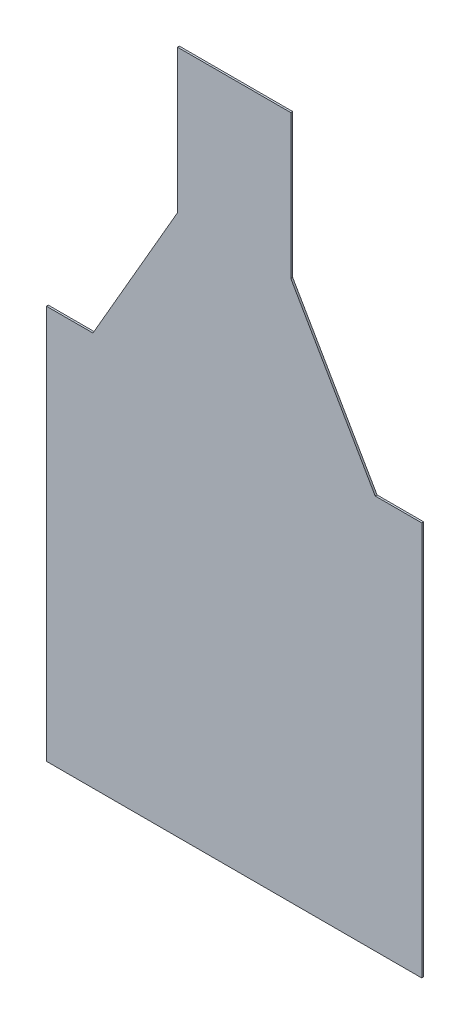
ISO-10303-21;
HEADER;
FILE_DESCRIPTION(('STEP AP214'),'2;1');
FILE_NAME('part.step','',(''),(''),'','','');
FILE_SCHEMA(('AUTOMOTIVE_DESIGN { 1 0 10303 214 1 1 1 1 }'));
ENDSEC;
DATA;
#1=APPLICATION_CONTEXT('core data for automotive mechanical design processes');
#2=APPLICATION_PROTOCOL_DEFINITION('international standard','automotive_design',2000,#1);
#3=PRODUCT_CONTEXT('',#1,'mechanical');
#4=PRODUCT('Part','Part','',(#3));
#5=PRODUCT_RELATED_PRODUCT_CATEGORY('part','',(#4));
#6=PRODUCT_DEFINITION_FORMATION('','',#4);
#7=PRODUCT_DEFINITION_CONTEXT('part definition',#1,'design');
#8=PRODUCT_DEFINITION('design','',#6,#7);
#9=PRODUCT_DEFINITION_SHAPE('','',#8);
#10=(LENGTH_UNIT() NAMED_UNIT(*) SI_UNIT(.MILLI.,.METRE.));
#11=(NAMED_UNIT(*) PLANE_ANGLE_UNIT() SI_UNIT($,.RADIAN.));
#12=(NAMED_UNIT(*) SI_UNIT($,.STERADIAN.) SOLID_ANGLE_UNIT());
#13=UNCERTAINTY_MEASURE_WITH_UNIT(LENGTH_MEASURE(1.E-05),#10,'distance_accuracy_value','');
#14=(GEOMETRIC_REPRESENTATION_CONTEXT(3) GLOBAL_UNCERTAINTY_ASSIGNED_CONTEXT((#13)) GLOBAL_UNIT_ASSIGNED_CONTEXT((#10,
#11,#12)) REPRESENTATION_CONTEXT('',''));
#15=CARTESIAN_POINT('',(0.,0.,0.));
#16=DIRECTION('',(0.,0.,1.));
#17=DIRECTION('',(1.,0.,0.));
#18=AXIS2_PLACEMENT_3D('',#15,#16,#17);
#19=CARTESIAN_POINT('',(-200.,238.575414968693,-2.));
#20=DIRECTION('',(0.,1.,0.));
#21=DIRECTION('',(0.,0.,1.));
#22=AXIS2_PLACEMENT_3D('',#19,#20,#21);
#23=PLANE('',#22);
#24=DIRECTION('',(-1.,0.,0.));
#25=VECTOR('',#24,1.);
#26=CARTESIAN_POINT('',(-200.,238.575414968693,-2.));
#27=LINE('',#26,#25);
#28=CARTESIAN_POINT('',(200.,238.575414968693,-2.));
#29=VERTEX_POINT('',#28);
#30=CARTESIAN_POINT('',(150.373607132281,238.575414968693,-2.));
#31=VERTEX_POINT('',#30);
#32=EDGE_CURVE('E149',#29,#31,#27,.T.);
#33=ORIENTED_EDGE('',*,*,#32,.T.);
#34=DIRECTION('',(0.,0.,1.));
#35=VECTOR('',#34,1.);
#36=CARTESIAN_POINT('',(150.373607132281,238.575414968693,-2.));
#37=LINE('',#36,#35);
#38=CARTESIAN_POINT('',(150.373607132281,238.575414968693,0.));
#39=VERTEX_POINT('',#38);
#40=EDGE_CURVE('E141',#31,#39,#37,.T.);
#41=ORIENTED_EDGE('',*,*,#40,.T.);
#42=DIRECTION('',(-1.,0.,0.));
#43=VECTOR('',#42,1.);
#44=CARTESIAN_POINT('',(-200.,238.575414968693,0.));
#45=LINE('',#44,#43);
#46=CARTESIAN_POINT('',(200.,238.575414968693,0.));
#47=VERTEX_POINT('',#46);
#48=EDGE_CURVE('E175',#47,#39,#45,.T.);
#49=ORIENTED_EDGE('',*,*,#48,.F.);
#50=DIRECTION('',(0.,0.,1.));
#51=VECTOR('',#50,1.);
#52=CARTESIAN_POINT('',(200.,238.575414968693,-2.));
#53=LINE('',#52,#51);
#54=EDGE_CURVE('E85',#29,#47,#53,.T.);
#55=ORIENTED_EDGE('',*,*,#54,.F.);
#56=EDGE_LOOP('',(#33,#41,#49,#55));
#57=FACE_BOUND('',#56,.T.);
#58=ADVANCED_FACE('F35',(#57),#23,.T.);
#59=CARTESIAN_POINT('',(200.,238.575414968693,-2.));
#60=DIRECTION('',(1.,0.,0.));
#61=DIRECTION('',(0.,1.,0.));
#62=AXIS2_PLACEMENT_3D('',#59,#60,#61);
#63=PLANE('',#62);
#64=DIRECTION('',(0.,1.,0.));
#65=VECTOR('',#64,1.);
#66=CARTESIAN_POINT('',(200.,238.575414968693,0.));
#67=LINE('',#66,#65);
#68=CARTESIAN_POINT('',(200.,-181.424585031307,0.));
#69=VERTEX_POINT('',#68);
#70=EDGE_CURVE('E166',#69,#47,#67,.T.);
#71=ORIENTED_EDGE('',*,*,#70,.F.);
#72=DIRECTION('',(0.,0.,1.));
#73=VECTOR('',#72,1.);
#74=CARTESIAN_POINT('',(200.,-181.424585031307,-2.));
#75=LINE('',#74,#73);
#76=CARTESIAN_POINT('',(200.,-181.424585031307,-2.));
#77=VERTEX_POINT('',#76);
#78=EDGE_CURVE('E11',#77,#69,#75,.T.);
#79=ORIENTED_EDGE('',*,*,#78,.F.);
#80=DIRECTION('',(0.,1.,0.));
#81=VECTOR('',#80,1.);
#82=CARTESIAN_POINT('',(200.,238.575414968693,-2.));
#83=LINE('',#82,#81);
#84=EDGE_CURVE('E150',#77,#29,#83,.T.);
#85=ORIENTED_EDGE('',*,*,#84,.T.);
#86=ORIENTED_EDGE('',*,*,#54,.T.);
#87=EDGE_LOOP('',(#71,#79,#85,#86));
#88=FACE_BOUND('',#87,.T.);
#89=ADVANCED_FACE('F37',(#88),#63,.T.);
#90=CARTESIAN_POINT('',(-200.,-181.424585031307,-2.));
#91=DIRECTION('',(0.,-1.,0.));
#92=DIRECTION('',(0.,0.,-1.));
#93=AXIS2_PLACEMENT_3D('',#90,#91,#92);
#94=PLANE('',#93);
#95=DIRECTION('',(1.,0.,0.));
#96=VECTOR('',#95,1.);
#97=CARTESIAN_POINT('',(-200.,-181.424585031307,0.));
#98=LINE('',#97,#96);
#99=CARTESIAN_POINT('',(-200.,-181.424585031307,0.));
#100=VERTEX_POINT('',#99);
#101=EDGE_CURVE('E153',#100,#69,#98,.T.);
#102=ORIENTED_EDGE('',*,*,#101,.F.);
#103=DIRECTION('',(0.,0.,1.));
#104=VECTOR('',#103,1.);
#105=CARTESIAN_POINT('',(-200.,-181.424585031307,-2.));
#106=LINE('',#105,#104);
#107=CARTESIAN_POINT('',(-200.,-181.424585031307,-2.));
#108=VERTEX_POINT('',#107);
#109=EDGE_CURVE('E44',#108,#100,#106,.T.);
#110=ORIENTED_EDGE('',*,*,#109,.F.);
#111=DIRECTION('',(1.,0.,0.));
#112=VECTOR('',#111,1.);
#113=CARTESIAN_POINT('',(-200.,-181.424585031307,-2.));
#114=LINE('',#113,#112);
#115=EDGE_CURVE('E164',#108,#77,#114,.T.);
#116=ORIENTED_EDGE('',*,*,#115,.T.);
#117=ORIENTED_EDGE('',*,*,#78,.T.);
#118=EDGE_LOOP('',(#102,#110,#116,#117));
#119=FACE_BOUND('',#118,.T.);
#120=ADVANCED_FACE('F187',(#119),#94,.T.);
#121=CARTESIAN_POINT('',(-200.,238.575414968693,-2.));
#122=DIRECTION('',(-1.,0.,0.));
#123=DIRECTION('',(0.,-1.,0.));
#124=AXIS2_PLACEMENT_3D('',#121,#122,#123);
#125=PLANE('',#124);
#126=DIRECTION('',(0.,-1.,0.));
#127=VECTOR('',#126,1.);
#128=CARTESIAN_POINT('',(-200.,238.575414968693,0.));
#129=LINE('',#128,#127);
#130=CARTESIAN_POINT('',(-200.,238.575414968693,0.));
#131=VERTEX_POINT('',#130);
#132=EDGE_CURVE('E171',#131,#100,#129,.T.);
#133=ORIENTED_EDGE('',*,*,#132,.F.);
#134=DIRECTION('',(0.,0.,1.));
#135=VECTOR('',#134,1.);
#136=CARTESIAN_POINT('',(-200.,238.575414968693,-2.));
#137=LINE('',#136,#135);
#138=CARTESIAN_POINT('',(-200.,238.575414968693,-2.));
#139=VERTEX_POINT('',#138);
#140=EDGE_CURVE('E179',#139,#131,#137,.T.);
#141=ORIENTED_EDGE('',*,*,#140,.F.);
#142=DIRECTION('',(0.,-1.,0.));
#143=VECTOR('',#142,1.);
#144=CARTESIAN_POINT('',(-200.,238.575414968693,-2.));
#145=LINE('',#144,#143);
#146=EDGE_CURVE('E148',#139,#108,#145,.T.);
#147=ORIENTED_EDGE('',*,*,#146,.T.);
#148=ORIENTED_EDGE('',*,*,#109,.T.);
#149=EDGE_LOOP('',(#133,#141,#147,#148));
#150=FACE_BOUND('',#149,.T.);
#151=ADVANCED_FACE('F188',(#150),#125,.T.);
#152=DIRECTION('',(0.,0.,1.));
#153=VECTOR('',#152,1.);
#154=CARTESIAN_POINT('',(-150.373607132281,238.575414968693,-2.));
#155=LINE('',#154,#153);
#156=CARTESIAN_POINT('',(-150.373607132281,238.575414968693,-2.));
#157=VERTEX_POINT('',#156);
#158=CARTESIAN_POINT('',(-150.373607132281,238.575414968693,0.));
#159=VERTEX_POINT('',#158);
#160=EDGE_CURVE('E124',#157,#159,#155,.T.);
#161=ORIENTED_EDGE('',*,*,#160,.F.);
#162=EDGE_CURVE('E138',#157,#139,#27,.T.);
#163=ORIENTED_EDGE('',*,*,#162,.T.);
#164=ORIENTED_EDGE('',*,*,#140,.T.);
#165=EDGE_CURVE('E140',#159,#131,#45,.T.);
#166=ORIENTED_EDGE('',*,*,#165,.F.);
#167=EDGE_LOOP('',(#161,#163,#164,#166));
#168=FACE_BOUND('',#167,.T.);
#169=ADVANCED_FACE('F136',(#168),#23,.T.);
#170=CARTESIAN_POINT('',(0.,0.,-2.));
#171=DIRECTION('',(0.,0.,1.));
#172=DIRECTION('',(1.,0.,0.));
#173=AXIS2_PLACEMENT_3D('',#170,#171,#172);
#174=PLANE('',#173);
#175=ORIENTED_EDGE('',*,*,#84,.F.);
#176=ORIENTED_EDGE('',*,*,#115,.F.);
#177=ORIENTED_EDGE('',*,*,#146,.F.);
#178=ORIENTED_EDGE('',*,*,#162,.F.);
#179=DIRECTION('',(-0.499999999999998,-0.86602540378444,0.));
#180=VECTOR('',#179,1.);
#181=CARTESIAN_POINT('',(-60.4218344464016,394.376455491523,-2.));
#182=LINE('',#181,#180);
#183=CARTESIAN_POINT('',(-60.4218344464016,394.376455491523,-2.));
#184=VERTEX_POINT('',#183);
#185=EDGE_CURVE('E120',#184,#157,#182,.T.);
#186=ORIENTED_EDGE('',*,*,#185,.F.);
#187=DIRECTION('',(0.,-1.,0.));
#188=VECTOR('',#187,1.);
#189=CARTESIAN_POINT('',(-60.4218344464016,394.376455491523,-2.));
#190=LINE('',#189,#188);
#191=CARTESIAN_POINT('',(-60.4218344464016,547.430628062216,-2.));
#192=VERTEX_POINT('',#191);
#193=EDGE_CURVE('E142',#192,#184,#190,.T.);
#194=ORIENTED_EDGE('',*,*,#193,.F.);
#195=DIRECTION('',(-1.,0.,0.));
#196=VECTOR('',#195,1.);
#197=CARTESIAN_POINT('',(-60.4218344464016,547.430628062216,-2.));
#198=LINE('',#197,#196);
#199=CARTESIAN_POINT('',(60.4218344464016,547.430628062216,-2.));
#200=VERTEX_POINT('',#199);
#201=EDGE_CURVE('E214',#200,#192,#198,.T.);
#202=ORIENTED_EDGE('',*,*,#201,.F.);
#203=DIRECTION('',(0.,1.,0.));
#204=VECTOR('',#203,1.);
#205=CARTESIAN_POINT('',(60.4218344464015,394.376455491523,-2.));
#206=LINE('',#205,#204);
#207=CARTESIAN_POINT('',(60.4218344464015,394.376455491523,-2.));
#208=VERTEX_POINT('',#207);
#209=EDGE_CURVE('E212',#208,#200,#206,.T.);
#210=ORIENTED_EDGE('',*,*,#209,.F.);
#211=DIRECTION('',(-0.499999999999998,0.86602540378444,0.));
#212=VECTOR('',#211,1.);
#213=CARTESIAN_POINT('',(60.4218344464015,394.376455491523,-2.));
#214=LINE('',#213,#212);
#215=EDGE_CURVE('E131',#31,#208,#214,.T.);
#216=ORIENTED_EDGE('',*,*,#215,.F.);
#217=ORIENTED_EDGE('',*,*,#32,.F.);
#218=EDGE_LOOP('',(#175,#176,#177,#178,#186,#194,#202,#210,#216,#217));
#219=FACE_BOUND('',#218,.T.);
#220=ADVANCED_FACE('F145',(#219),#174,.F.);
#221=CARTESIAN_POINT('',(0.,0.,0.));
#222=DIRECTION('',(0.,0.,1.));
#223=DIRECTION('',(1.,0.,0.));
#224=AXIS2_PLACEMENT_3D('',#221,#222,#223);
#225=PLANE('',#224);
#226=ORIENTED_EDGE('',*,*,#70,.T.);
#227=ORIENTED_EDGE('',*,*,#48,.T.);
#228=DIRECTION('',(-0.499999999999998,0.86602540378444,0.));
#229=VECTOR('',#228,1.);
#230=CARTESIAN_POINT('',(60.4218344464015,394.376455491523,0.));
#231=LINE('',#230,#229);
#232=CARTESIAN_POINT('',(60.4218344464015,394.376455491523,0.));
#233=VERTEX_POINT('',#232);
#234=EDGE_CURVE('E52',#39,#233,#231,.T.);
#235=ORIENTED_EDGE('',*,*,#234,.T.);
#236=DIRECTION('',(0.,1.,0.));
#237=VECTOR('',#236,1.);
#238=CARTESIAN_POINT('',(60.4218344464015,394.376455491523,0.));
#239=LINE('',#238,#237);
#240=CARTESIAN_POINT('',(60.4218344464016,547.430628062216,0.));
#241=VERTEX_POINT('',#240);
#242=EDGE_CURVE('E193',#233,#241,#239,.T.);
#243=ORIENTED_EDGE('',*,*,#242,.T.);
#244=DIRECTION('',(-1.,0.,0.));
#245=VECTOR('',#244,1.);
#246=CARTESIAN_POINT('',(-60.4218344464016,547.430628062216,0.));
#247=LINE('',#246,#245);
#248=CARTESIAN_POINT('',(-60.4218344464016,547.430628062216,0.));
#249=VERTEX_POINT('',#248);
#250=EDGE_CURVE('E195',#241,#249,#247,.T.);
#251=ORIENTED_EDGE('',*,*,#250,.T.);
#252=DIRECTION('',(0.,-1.,0.));
#253=VECTOR('',#252,1.);
#254=CARTESIAN_POINT('',(-60.4218344464016,394.376455491523,0.));
#255=LINE('',#254,#253);
#256=CARTESIAN_POINT('',(-60.4218344464016,394.376455491523,0.));
#257=VERTEX_POINT('',#256);
#258=EDGE_CURVE('E132',#249,#257,#255,.T.);
#259=ORIENTED_EDGE('',*,*,#258,.T.);
#260=DIRECTION('',(-0.499999999999998,-0.86602540378444,0.));
#261=VECTOR('',#260,1.);
#262=CARTESIAN_POINT('',(-60.4218344464016,394.376455491523,0.));
#263=LINE('',#262,#261);
#264=EDGE_CURVE('E194',#257,#159,#263,.T.);
#265=ORIENTED_EDGE('',*,*,#264,.T.);
#266=ORIENTED_EDGE('',*,*,#165,.T.);
#267=ORIENTED_EDGE('',*,*,#132,.T.);
#268=ORIENTED_EDGE('',*,*,#101,.T.);
#269=EDGE_LOOP('',(#226,#227,#235,#243,#251,#259,#265,#266,#267,#268));
#270=FACE_BOUND('',#269,.T.);
#271=ADVANCED_FACE('F185',(#270),#225,.T.);
#272=CARTESIAN_POINT('',(-60.4218344464016,394.376455491523,-2.));
#273=DIRECTION('',(-0.86602540378444,0.499999999999998,0.));
#274=DIRECTION('',(-0.499999999999998,-0.86602540378444,0.));
#275=AXIS2_PLACEMENT_3D('',#272,#273,#274);
#276=PLANE('',#275);
#277=ORIENTED_EDGE('',*,*,#264,.F.);
#278=DIRECTION('',(0.,0.,1.));
#279=VECTOR('',#278,1.);
#280=CARTESIAN_POINT('',(-60.4218344464016,394.376455491523,-2.));
#281=LINE('',#280,#279);
#282=EDGE_CURVE('E126',#184,#257,#281,.T.);
#283=ORIENTED_EDGE('',*,*,#282,.F.);
#284=ORIENTED_EDGE('',*,*,#185,.T.);
#285=ORIENTED_EDGE('',*,*,#160,.T.);
#286=EDGE_LOOP('',(#277,#283,#284,#285));
#287=FACE_BOUND('',#286,.T.);
#288=ADVANCED_FACE('F123',(#287),#276,.T.);
#289=CARTESIAN_POINT('',(-60.4218344464016,394.376455491523,-2.));
#290=DIRECTION('',(-1.,0.,0.));
#291=DIRECTION('',(0.,0.,1.));
#292=AXIS2_PLACEMENT_3D('',#289,#290,#291);
#293=PLANE('',#292);
#294=ORIENTED_EDGE('',*,*,#258,.F.);
#295=DIRECTION('',(0.,0.,1.));
#296=VECTOR('',#295,1.);
#297=CARTESIAN_POINT('',(-60.4218344464016,547.430628062216,-2.));
#298=LINE('',#297,#296);
#299=EDGE_CURVE('E225',#192,#249,#298,.T.);
#300=ORIENTED_EDGE('',*,*,#299,.F.);
#301=ORIENTED_EDGE('',*,*,#193,.T.);
#302=ORIENTED_EDGE('',*,*,#282,.T.);
#303=EDGE_LOOP('',(#294,#300,#301,#302));
#304=FACE_BOUND('',#303,.T.);
#305=ADVANCED_FACE('F238',(#304),#293,.T.);
#306=CARTESIAN_POINT('',(-60.4218344464016,547.430628062216,-2.));
#307=DIRECTION('',(0.,1.,0.));
#308=DIRECTION('',(0.,0.,1.));
#309=AXIS2_PLACEMENT_3D('',#306,#307,#308);
#310=PLANE('',#309);
#311=ORIENTED_EDGE('',*,*,#250,.F.);
#312=DIRECTION('',(0.,0.,1.));
#313=VECTOR('',#312,1.);
#314=CARTESIAN_POINT('',(60.4218344464016,547.430628062216,-2.));
#315=LINE('',#314,#313);
#316=EDGE_CURVE('E226',#200,#241,#315,.T.);
#317=ORIENTED_EDGE('',*,*,#316,.F.);
#318=ORIENTED_EDGE('',*,*,#201,.T.);
#319=ORIENTED_EDGE('',*,*,#299,.T.);
#320=EDGE_LOOP('',(#311,#317,#318,#319));
#321=FACE_BOUND('',#320,.T.);
#322=ADVANCED_FACE('F231',(#321),#310,.T.);
#323=CARTESIAN_POINT('',(60.4218344464015,394.376455491523,-2.));
#324=DIRECTION('',(1.,0.,0.));
#325=DIRECTION('',(0.,1.,0.));
#326=AXIS2_PLACEMENT_3D('',#323,#324,#325);
#327=PLANE('',#326);
#328=ORIENTED_EDGE('',*,*,#242,.F.);
#329=DIRECTION('',(0.,0.,1.));
#330=VECTOR('',#329,1.);
#331=CARTESIAN_POINT('',(60.4218344464015,394.376455491523,-2.));
#332=LINE('',#331,#330);
#333=EDGE_CURVE('E207',#208,#233,#332,.T.);
#334=ORIENTED_EDGE('',*,*,#333,.F.);
#335=ORIENTED_EDGE('',*,*,#209,.T.);
#336=ORIENTED_EDGE('',*,*,#316,.T.);
#337=EDGE_LOOP('',(#328,#334,#335,#336));
#338=FACE_BOUND('',#337,.T.);
#339=ADVANCED_FACE('F229',(#338),#327,.T.);
#340=CARTESIAN_POINT('',(60.4218344464015,394.376455491523,-2.));
#341=DIRECTION('',(0.86602540378444,0.499999999999998,0.));
#342=DIRECTION('',(-0.499999999999998,0.86602540378444,0.));
#343=AXIS2_PLACEMENT_3D('',#340,#341,#342);
#344=PLANE('',#343);
#345=ORIENTED_EDGE('',*,*,#234,.F.);
#346=ORIENTED_EDGE('',*,*,#40,.F.);
#347=ORIENTED_EDGE('',*,*,#215,.T.);
#348=ORIENTED_EDGE('',*,*,#333,.T.);
#349=EDGE_LOOP('',(#345,#346,#347,#348));
#350=FACE_BOUND('',#349,.T.);
#351=ADVANCED_FACE('F228',(#350),#344,.T.);
#352=CLOSED_SHELL('',(#58,#89,#120,#151,#169,#220,#271,#288,#305,#322,#339,#351));
#353=MANIFOLD_SOLID_BREP('B2',#352);
#354=ADVANCED_BREP_SHAPE_REPRESENTATION('',(#18,#353),#14);
#355=SHAPE_DEFINITION_REPRESENTATION(#9,#354);
ENDSEC;
END-ISO-10303-21;
